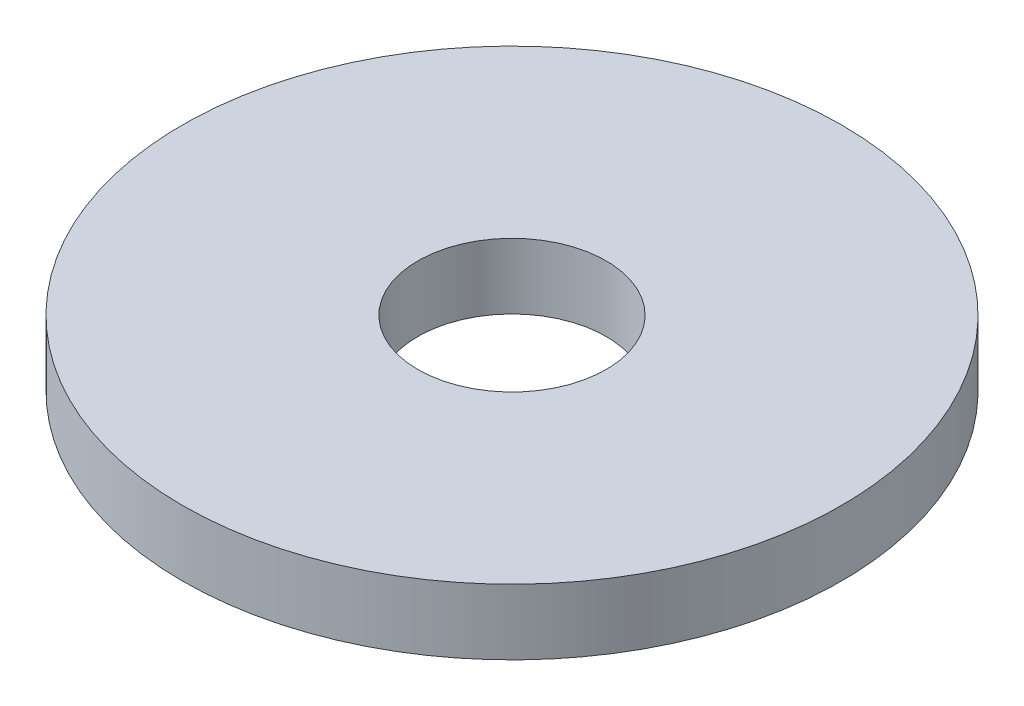
ISO-10303-21;
HEADER;
FILE_DESCRIPTION(('STEP AP214'),'2;1');
FILE_NAME('part.step','',(''),(''),'','','');
FILE_SCHEMA(('AUTOMOTIVE_DESIGN { 1 0 10303 214 1 1 1 1 }'));
ENDSEC;
DATA;
#1=APPLICATION_CONTEXT('core data for automotive mechanical design processes');
#2=APPLICATION_PROTOCOL_DEFINITION('international standard','automotive_design',2000,#1);
#3=PRODUCT_CONTEXT('',#1,'mechanical');
#4=PRODUCT('Part','Part','',(#3));
#5=PRODUCT_RELATED_PRODUCT_CATEGORY('part','',(#4));
#6=PRODUCT_DEFINITION_FORMATION('','',#4);
#7=PRODUCT_DEFINITION_CONTEXT('part definition',#1,'design');
#8=PRODUCT_DEFINITION('design','',#6,#7);
#9=PRODUCT_DEFINITION_SHAPE('','',#8);
#10=(LENGTH_UNIT() NAMED_UNIT(*) SI_UNIT(.MILLI.,.METRE.));
#11=(NAMED_UNIT(*) PLANE_ANGLE_UNIT() SI_UNIT($,.RADIAN.));
#12=(NAMED_UNIT(*) SI_UNIT($,.STERADIAN.) SOLID_ANGLE_UNIT());
#13=UNCERTAINTY_MEASURE_WITH_UNIT(LENGTH_MEASURE(1.E-05),#10,'distance_accuracy_value','');
#14=(GEOMETRIC_REPRESENTATION_CONTEXT(3) GLOBAL_UNCERTAINTY_ASSIGNED_CONTEXT((#13)) GLOBAL_UNIT_ASSIGNED_CONTEXT((#10,
#11,#12)) REPRESENTATION_CONTEXT('',''));
#15=CARTESIAN_POINT('',(0.,0.,0.));
#16=DIRECTION('',(0.,0.,1.));
#17=DIRECTION('',(1.,0.,0.));
#18=AXIS2_PLACEMENT_3D('',#15,#16,#17);
#19=CARTESIAN_POINT('',(0.,2.2098,0.));
#20=DIRECTION('',(0.,1.,0.));
#21=DIRECTION('',(0.,0.,1.));
#22=AXIS2_PLACEMENT_3D('',#19,#20,#21);
#23=PLANE('',#22);
#24=CARTESIAN_POINT('',(0.,2.2098,0.));
#25=DIRECTION('',(0.,1.,0.));
#26=DIRECTION('',(0.,0.,1.));
#27=AXIS2_PLACEMENT_3D('',#24,#25,#26);
#28=CIRCLE('',#27,11.1125);
#29=CARTESIAN_POINT('',(0.,2.2098,11.1125));
#30=VERTEX_POINT('',#29);
#31=EDGE_CURVE('E10',#30,#30,#28,.T.);
#32=ORIENTED_EDGE('',*,*,#31,.T.);
#33=EDGE_LOOP('',(#32));
#34=FACE_BOUND('',#33,.T.);
#35=CARTESIAN_POINT('',(0.,2.2098,0.));
#36=DIRECTION('',(0.,1.,0.));
#37=DIRECTION('',(0.,0.,1.));
#38=AXIS2_PLACEMENT_3D('',#35,#36,#37);
#39=CIRCLE('',#38,3.175);
#40=CARTESIAN_POINT('',(0.,2.2098,3.175));
#41=VERTEX_POINT('',#40);
#42=EDGE_CURVE('E42',#41,#41,#39,.T.);
#43=ORIENTED_EDGE('',*,*,#42,.F.);
#44=EDGE_LOOP('',(#43));
#45=FACE_BOUND('',#44,.T.);
#46=ADVANCED_FACE('F31',(#34,#45),#23,.T.);
#47=CARTESIAN_POINT('',(0.,0.,0.));
#48=DIRECTION('',(0.,1.,0.));
#49=DIRECTION('',(0.,0.,1.));
#50=AXIS2_PLACEMENT_3D('',#47,#48,#49);
#51=PLANE('',#50);
#52=CARTESIAN_POINT('',(0.,0.,0.));
#53=DIRECTION('',(0.,1.,0.));
#54=DIRECTION('',(0.,0.,1.));
#55=AXIS2_PLACEMENT_3D('',#52,#53,#54);
#56=CIRCLE('',#55,11.1125);
#57=CARTESIAN_POINT('',(0.,0.,11.1125));
#58=VERTEX_POINT('',#57);
#59=EDGE_CURVE('E35',#58,#58,#56,.T.);
#60=ORIENTED_EDGE('',*,*,#59,.F.);
#61=EDGE_LOOP('',(#60));
#62=FACE_BOUND('',#61,.T.);
#63=CARTESIAN_POINT('',(0.,0.,0.));
#64=DIRECTION('',(0.,1.,0.));
#65=DIRECTION('',(0.,0.,1.));
#66=AXIS2_PLACEMENT_3D('',#63,#64,#65);
#67=CIRCLE('',#66,3.175);
#68=CARTESIAN_POINT('',(0.,0.,3.175));
#69=VERTEX_POINT('',#68);
#70=EDGE_CURVE('E44',#69,#69,#67,.T.);
#71=ORIENTED_EDGE('',*,*,#70,.T.);
#72=EDGE_LOOP('',(#71));
#73=FACE_BOUND('',#72,.T.);
#74=ADVANCED_FACE('F54',(#62,#73),#51,.F.);
#75=CARTESIAN_POINT('',(0.,2.2098,0.));
#76=DIRECTION('',(0.,-1.,0.));
#77=DIRECTION('',(0.,0.,-1.));
#78=AXIS2_PLACEMENT_3D('',#75,#76,#77);
#79=CYLINDRICAL_SURFACE('',#78,11.1125);
#80=ORIENTED_EDGE('',*,*,#31,.F.);
#81=EDGE_LOOP('',(#80));
#82=FACE_BOUND('',#81,.T.);
#83=ORIENTED_EDGE('',*,*,#59,.T.);
#84=EDGE_LOOP('',(#83));
#85=FACE_BOUND('',#84,.T.);
#86=ADVANCED_FACE('F33',(#82,#85),#79,.T.);
#87=CARTESIAN_POINT('',(0.,2.2098,0.));
#88=DIRECTION('',(0.,-1.,0.));
#89=DIRECTION('',(0.,0.,-1.));
#90=AXIS2_PLACEMENT_3D('',#87,#88,#89);
#91=CYLINDRICAL_SURFACE('',#90,3.175);
#92=ORIENTED_EDGE('',*,*,#42,.T.);
#93=EDGE_LOOP('',(#92));
#94=FACE_BOUND('',#93,.T.);
#95=ORIENTED_EDGE('',*,*,#70,.F.);
#96=EDGE_LOOP('',(#95));
#97=FACE_BOUND('',#96,.T.);
#98=ADVANCED_FACE('F50',(#94,#97),#91,.F.);
#99=CLOSED_SHELL('',(#46,#74,#86,#98));
#100=MANIFOLD_SOLID_BREP('B2',#99);
#101=ADVANCED_BREP_SHAPE_REPRESENTATION('',(#18,#100),#14);
#102=SHAPE_DEFINITION_REPRESENTATION(#9,#101);
ENDSEC;
END-ISO-10303-21;
